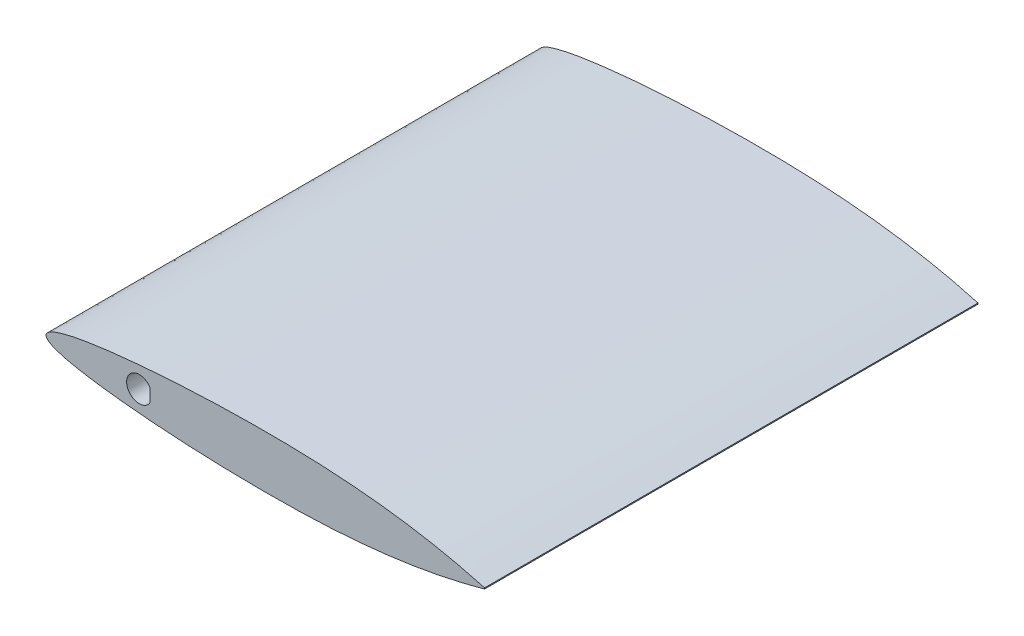
ISO-10303-21;
HEADER;
FILE_DESCRIPTION(('STEP AP214'),'2;1');
FILE_NAME('part.step','',(''),(''),'','','');
FILE_SCHEMA(('AUTOMOTIVE_DESIGN { 1 0 10303 214 1 1 1 1 }'));
ENDSEC;
DATA;
#1=APPLICATION_CONTEXT('core data for automotive mechanical design processes');
#2=APPLICATION_PROTOCOL_DEFINITION('international standard','automotive_design',2000,#1);
#3=PRODUCT_CONTEXT('',#1,'mechanical');
#4=PRODUCT('Part','Part','',(#3));
#5=PRODUCT_RELATED_PRODUCT_CATEGORY('part','',(#4));
#6=PRODUCT_DEFINITION_FORMATION('','',#4);
#7=PRODUCT_DEFINITION_CONTEXT('part definition',#1,'design');
#8=PRODUCT_DEFINITION('design','',#6,#7);
#9=PRODUCT_DEFINITION_SHAPE('','',#8);
#10=(LENGTH_UNIT() NAMED_UNIT(*) SI_UNIT(.MILLI.,.METRE.));
#11=(NAMED_UNIT(*) PLANE_ANGLE_UNIT() SI_UNIT($,.RADIAN.));
#12=(NAMED_UNIT(*) SI_UNIT($,.STERADIAN.) SOLID_ANGLE_UNIT());
#13=UNCERTAINTY_MEASURE_WITH_UNIT(LENGTH_MEASURE(1.E-05),#10,'distance_accuracy_value','');
#14=(GEOMETRIC_REPRESENTATION_CONTEXT(3) GLOBAL_UNCERTAINTY_ASSIGNED_CONTEXT((#13)) GLOBAL_UNIT_ASSIGNED_CONTEXT((#10,
#11,#12)) REPRESENTATION_CONTEXT('',''));
#15=CARTESIAN_POINT('',(0.,0.,0.));
#16=DIRECTION('',(0.,0.,1.));
#17=DIRECTION('',(1.,0.,0.));
#18=AXIS2_PLACEMENT_3D('',#15,#16,#17);
#19=CARTESIAN_POINT('',(0.,0.,114.3));
#20=DIRECTION('',(0.,0.,-1.));
#21=DIRECTION('',(-1.,0.,0.));
#22=AXIS2_PLACEMENT_3D('',#19,#20,#21);
#23=PLANE('',#22);
#24=CARTESIAN_POINT('',(101.6,0.12192,114.3));
#25=CARTESIAN_POINT('',(99.9099325612772,0.573751352181052,114.3));
#26=CARTESIAN_POINT('',(96.5445159680375,1.47347919447663,114.3));
#27=CARTESIAN_POINT('',(89.7838148331715,2.94708160059314,114.3));
#28=CARTESIAN_POINT('',(81.3219135939672,4.36676175035151,114.3));
#29=CARTESIAN_POINT('',(71.1402798710456,5.43635651611942,114.3));
#30=CARTESIAN_POINT('',(60.9671026158848,5.99664541123932,114.3));
#31=CARTESIAN_POINT('',(50.8000062626756,6.1452466793128,114.3));
#32=CARTESIAN_POINT('',(40.6356759168472,5.99825351295323,114.3));
#33=CARTESIAN_POINT('',(30.4708305225493,5.55295405436998,114.3));
#34=CARTESIAN_POINT('',(22.0030483871038,4.93293242186221,114.3));
#35=CARTESIAN_POINT('',(15.230811890989,4.22316272662785,114.3));
#36=CARTESIAN_POINT('',(10.9986814626437,3.664214628241,114.3));
#37=CARTESIAN_POINT('',(7.60803033342346,3.09224166583172,114.3));
#38=CARTESIAN_POINT('',(5.07214941301361,2.58080453358446,114.3));
#39=CARTESIAN_POINT('',(2.89436287038461,1.97088859116428,114.3));
#40=CARTESIAN_POINT('',(1.18166517439631,1.36420918614566,114.3));
#41=CARTESIAN_POINT('',(-0.674617494040787,0.,114.3));
#42=CARTESIAN_POINT('',(1.18166517439633,-1.36420918614567,114.3));
#43=CARTESIAN_POINT('',(2.89436287038458,-1.97088859116427,114.3));
#44=CARTESIAN_POINT('',(5.07214941301364,-2.58080453358447,114.3));
#45=CARTESIAN_POINT('',(7.60803033342344,-3.09224166583172,114.3));
#46=CARTESIAN_POINT('',(10.9986814626437,-3.66421462824101,114.3));
#47=CARTESIAN_POINT('',(15.230811890989,-4.22316272662785,114.3));
#48=CARTESIAN_POINT('',(22.0030483871038,-4.93293242186221,114.3));
#49=CARTESIAN_POINT('',(30.4708305225493,-5.55295405436998,114.3));
#50=CARTESIAN_POINT('',(40.6356759168473,-5.99825351295323,114.3));
#51=CARTESIAN_POINT('',(50.8000062626756,-6.1452466793128,114.3));
#52=CARTESIAN_POINT('',(60.9671026158848,-5.99664541123932,114.3));
#53=CARTESIAN_POINT('',(71.1402798710456,-5.43635651611942,114.3));
#54=CARTESIAN_POINT('',(81.3219135939672,-4.3667617503515,114.3));
#55=CARTESIAN_POINT('',(89.7838148331716,-2.94708160059315,114.3));
#56=CARTESIAN_POINT('',(96.5445159680374,-1.47347919447663,114.3));
#57=CARTESIAN_POINT('',(99.9099325612772,-0.573751352181052,114.3));
#58=CARTESIAN_POINT('',(101.6,-0.12192,114.3));
#59=B_SPLINE_CURVE_WITH_KNOTS('',3,(#24,#25,#26,#27,#28,#29,#30,#31,#32,#33,#34,#35,#36,#37,#38,
#39,#40,#41,#42,#43,#44,#45,#46,#47,#48,#49,#50,#51,#52,#53,#54,#55,#56,#57,#58),.UNSPECIFIED.,
.F.,.F.,(4,1,1,1,1,1,1,1,1,1,1,1,1,1,1,1,1,1,1,1,1,1,1,1,1,1,1,1,1,1,1,1,4),(0.,
0.0254561411236664,0.0506905924429752,0.100668945434382,0.150236314349449,0.19960123058025,
0.24889397315785,0.298185188052663,0.347518475522579,0.396944040111351,0.421724595809467,
0.44659314081436,0.4590914269835,0.471679671517261,0.484480399814962,0.491139796608888,0.5,
0.508860203391112,0.515519600185038,0.528320328482739,0.5409085730165,0.55340685918564,
0.578275404190533,0.603055959888649,0.652481524477421,0.701814811947337,0.75110602684215,
0.80039876941975,0.849763685650551,0.899331054565618,0.949309407557025,0.974543858876334,1.),.UNSPECIFIED.);
#60=CARTESIAN_POINT('',(101.6,0.12192,114.3));
#61=VERTEX_POINT('',#60);
#62=CARTESIAN_POINT('',(101.6,-0.12192,114.3));
#63=VERTEX_POINT('',#62);
#64=EDGE_CURVE('E91',#61,#63,#59,.T.);
#65=ORIENTED_EDGE('',*,*,#64,.T.);
#66=DIRECTION('',(0.,1.,0.));
#67=VECTOR('',#66,1.);
#68=CARTESIAN_POINT('',(101.6,0.12192,114.3));
#69=LINE('',#68,#67);
#70=EDGE_CURVE('E97',#63,#61,#69,.T.);
#71=ORIENTED_EDGE('',*,*,#70,.T.);
#72=EDGE_LOOP('',(#65,#71));
#73=FACE_BOUND('',#72,.T.);
#74=DIRECTION('',(0.,-1.,0.));
#75=VECTOR('',#74,1.);
#76=CARTESIAN_POINT('',(24.0567191027873,0.,114.3));
#77=LINE('',#76,#75);
#78=CARTESIAN_POINT('',(24.0567191027873,1.5875,114.3));
#79=VERTEX_POINT('',#78);
#80=CARTESIAN_POINT('',(24.0567191027873,-1.5875,114.3));
#81=VERTEX_POINT('',#80);
#82=EDGE_CURVE('E49',#79,#81,#77,.T.);
#83=ORIENTED_EDGE('',*,*,#82,.T.);
#84=CARTESIAN_POINT('',(21.6,0.,114.3));
#85=DIRECTION('',(0.,0.,1.));
#86=DIRECTION('',(1.,0.,0.));
#87=AXIS2_PLACEMENT_3D('',#84,#85,#86);
#88=CIRCLE('',#87,2.925);
#89=EDGE_CURVE('E85',#79,#81,#88,.T.);
#90=ORIENTED_EDGE('',*,*,#89,.F.);
#91=EDGE_LOOP('',(#83,#90));
#92=FACE_BOUND('',#91,.T.);
#93=ADVANCED_FACE('F33',(#73,#92),#23,.F.);
#94=CARTESIAN_POINT('',(0.,0.,0.));
#95=DIRECTION('',(0.,0.,-1.));
#96=DIRECTION('',(-1.,0.,0.));
#97=AXIS2_PLACEMENT_3D('',#94,#95,#96);
#98=PLANE('',#97);
#99=CARTESIAN_POINT('',(101.6,0.12192,0.));
#100=CARTESIAN_POINT('',(99.9099325612772,0.573751352181052,0.));
#101=CARTESIAN_POINT('',(96.5445159680375,1.47347919447663,0.));
#102=CARTESIAN_POINT('',(89.7838148331715,2.94708160059314,0.));
#103=CARTESIAN_POINT('',(81.3219135939672,4.36676175035151,0.));
#104=CARTESIAN_POINT('',(71.1402798710456,5.43635651611942,0.));
#105=CARTESIAN_POINT('',(60.9671026158848,5.99664541123932,0.));
#106=CARTESIAN_POINT('',(50.8000062626756,6.1452466793128,0.));
#107=CARTESIAN_POINT('',(40.6356759168472,5.99825351295323,0.));
#108=CARTESIAN_POINT('',(30.4708305225493,5.55295405436998,0.));
#109=CARTESIAN_POINT('',(22.0030483871038,4.93293242186221,0.));
#110=CARTESIAN_POINT('',(15.230811890989,4.22316272662785,0.));
#111=CARTESIAN_POINT('',(10.9986814626437,3.664214628241,0.));
#112=CARTESIAN_POINT('',(7.60803033342346,3.09224166583172,0.));
#113=CARTESIAN_POINT('',(5.07214941301361,2.58080453358446,0.));
#114=CARTESIAN_POINT('',(2.89436287038461,1.97088859116428,0.));
#115=CARTESIAN_POINT('',(1.18166517439631,1.36420918614566,0.));
#116=CARTESIAN_POINT('',(-0.674617494040787,0.,0.));
#117=CARTESIAN_POINT('',(1.18166517439633,-1.36420918614567,0.));
#118=CARTESIAN_POINT('',(2.89436287038458,-1.97088859116427,0.));
#119=CARTESIAN_POINT('',(5.07214941301364,-2.58080453358447,0.));
#120=CARTESIAN_POINT('',(7.60803033342344,-3.09224166583172,0.));
#121=CARTESIAN_POINT('',(10.9986814626437,-3.66421462824101,0.));
#122=CARTESIAN_POINT('',(15.230811890989,-4.22316272662785,0.));
#123=CARTESIAN_POINT('',(22.0030483871038,-4.93293242186221,0.));
#124=CARTESIAN_POINT('',(30.4708305225493,-5.55295405436998,0.));
#125=CARTESIAN_POINT('',(40.6356759168473,-5.99825351295323,0.));
#126=CARTESIAN_POINT('',(50.8000062626756,-6.1452466793128,0.));
#127=CARTESIAN_POINT('',(60.9671026158848,-5.99664541123932,0.));
#128=CARTESIAN_POINT('',(71.1402798710456,-5.43635651611942,0.));
#129=CARTESIAN_POINT('',(81.3219135939672,-4.3667617503515,0.));
#130=CARTESIAN_POINT('',(89.7838148331716,-2.94708160059315,0.));
#131=CARTESIAN_POINT('',(96.5445159680374,-1.47347919447663,0.));
#132=CARTESIAN_POINT('',(99.9099325612772,-0.573751352181052,0.));
#133=CARTESIAN_POINT('',(101.6,-0.12192,0.));
#134=B_SPLINE_CURVE_WITH_KNOTS('',3,(#99,#100,#101,#102,#103,#104,#105,#106,#107,#108,#109,#110,
#111,#112,#113,#114,#115,#116,#117,#118,#119,#120,#121,#122,#123,#124,#125,#126,#127,#128,#129,
#130,#131,#132,#133),.UNSPECIFIED.,.F.,.F.,(4,1,1,1,1,1,1,1,1,1,1,1,1,1,1,1,1,1,1,1,1,1,1,1,1,1,
1,1,1,1,1,1,4),(0.,0.0254561411236664,0.0506905924429752,0.100668945434382,0.150236314349449,
0.19960123058025,0.24889397315785,0.298185188052663,0.347518475522579,0.396944040111351,
0.421724595809467,0.44659314081436,0.4590914269835,0.471679671517261,0.484480399814962,
0.491139796608888,0.5,0.508860203391112,0.515519600185038,0.528320328482739,0.5409085730165,
0.55340685918564,0.578275404190533,0.603055959888649,0.652481524477421,0.701814811947337,
0.75110602684215,0.80039876941975,0.849763685650551,0.899331054565618,0.949309407557025,
0.974543858876334,1.),.UNSPECIFIED.);
#135=CARTESIAN_POINT('',(101.6,0.12192,0.));
#136=VERTEX_POINT('',#135);
#137=CARTESIAN_POINT('',(101.6,-0.12192,0.));
#138=VERTEX_POINT('',#137);
#139=EDGE_CURVE('E90',#136,#138,#134,.T.);
#140=ORIENTED_EDGE('',*,*,#139,.F.);
#141=DIRECTION('',(0.,1.,0.));
#142=VECTOR('',#141,1.);
#143=CARTESIAN_POINT('',(101.6,0.12192,0.));
#144=LINE('',#143,#142);
#145=EDGE_CURVE('E98',#138,#136,#144,.T.);
#146=ORIENTED_EDGE('',*,*,#145,.F.);
#147=EDGE_LOOP('',(#140,#146));
#148=FACE_BOUND('',#147,.T.);
#149=CARTESIAN_POINT('',(21.6,0.,0.));
#150=DIRECTION('',(0.,0.,1.));
#151=DIRECTION('',(1.,0.,0.));
#152=AXIS2_PLACEMENT_3D('',#149,#150,#151);
#153=CIRCLE('',#152,2.925);
#154=CARTESIAN_POINT('',(24.0567191027873,1.5875,0.));
#155=VERTEX_POINT('',#154);
#156=CARTESIAN_POINT('',(24.0567191027873,-1.5875,0.));
#157=VERTEX_POINT('',#156);
#158=EDGE_CURVE('E79',#155,#157,#153,.T.);
#159=ORIENTED_EDGE('',*,*,#158,.T.);
#160=DIRECTION('',(0.,-1.,0.));
#161=VECTOR('',#160,1.);
#162=CARTESIAN_POINT('',(24.0567191027873,0.,0.));
#163=LINE('',#162,#161);
#164=EDGE_CURVE('E76',#155,#157,#163,.T.);
#165=ORIENTED_EDGE('',*,*,#164,.F.);
#166=EDGE_LOOP('',(#159,#165));
#167=FACE_BOUND('',#166,.T.);
#168=ADVANCED_FACE('F84',(#148,#167),#98,.T.);
#169=DIRECTION('',(0.,0.,-1.));
#170=VECTOR('',#169,1.);
#171=SURFACE_OF_LINEAR_EXTRUSION('',#59,#170);
#172=ORIENTED_EDGE('',*,*,#139,.T.);
#173=DIRECTION('',(0.,0.,-1.));
#174=VECTOR('',#173,1.);
#175=CARTESIAN_POINT('',(101.6,-0.12192,114.3));
#176=LINE('',#175,#174);
#177=EDGE_CURVE('E11',#63,#138,#176,.T.);
#178=ORIENTED_EDGE('',*,*,#177,.F.);
#179=ORIENTED_EDGE('',*,*,#64,.F.);
#180=DIRECTION('',(0.,0.,-1.));
#181=VECTOR('',#180,1.);
#182=CARTESIAN_POINT('',(101.6,0.12192,114.3));
#183=LINE('',#182,#181);
#184=EDGE_CURVE('E42',#61,#136,#183,.T.);
#185=ORIENTED_EDGE('',*,*,#184,.T.);
#186=EDGE_LOOP('',(#172,#178,#179,#185));
#187=FACE_BOUND('',#186,.T.);
#188=ADVANCED_FACE('F35',(#187),#171,.F.);
#189=CARTESIAN_POINT('',(101.6,0.12192,114.3));
#190=DIRECTION('',(-1.,0.,0.));
#191=DIRECTION('',(0.,-1.,0.));
#192=AXIS2_PLACEMENT_3D('',#189,#190,#191);
#193=PLANE('',#192);
#194=ORIENTED_EDGE('',*,*,#145,.T.);
#195=ORIENTED_EDGE('',*,*,#184,.F.);
#196=ORIENTED_EDGE('',*,*,#70,.F.);
#197=ORIENTED_EDGE('',*,*,#177,.T.);
#198=EDGE_LOOP('',(#194,#195,#196,#197));
#199=FACE_BOUND('',#198,.T.);
#200=ADVANCED_FACE('F118',(#199),#193,.F.);
#201=CARTESIAN_POINT('',(24.0567191027873,0.,0.));
#202=DIRECTION('',(-1.,0.,0.));
#203=DIRECTION('',(0.,0.,1.));
#204=AXIS2_PLACEMENT_3D('',#201,#202,#203);
#205=PLANE('',#204);
#206=ORIENTED_EDGE('',*,*,#82,.F.);
#207=DIRECTION('',(0.,0.,1.));
#208=VECTOR('',#207,1.);
#209=CARTESIAN_POINT('',(24.0567191027873,1.5875,0.));
#210=LINE('',#209,#208);
#211=EDGE_CURVE('E73',#155,#79,#210,.T.);
#212=ORIENTED_EDGE('',*,*,#211,.F.);
#213=ORIENTED_EDGE('',*,*,#164,.T.);
#214=DIRECTION('',(0.,0.,1.));
#215=VECTOR('',#214,1.);
#216=CARTESIAN_POINT('',(24.0567191027873,-1.5875,0.));
#217=LINE('',#216,#215);
#218=EDGE_CURVE('E56',#157,#81,#217,.T.);
#219=ORIENTED_EDGE('',*,*,#218,.T.);
#220=EDGE_LOOP('',(#206,#212,#213,#219));
#221=FACE_BOUND('',#220,.T.);
#222=ADVANCED_FACE('F74',(#221),#205,.T.);
#223=CARTESIAN_POINT('',(21.6,0.,0.));
#224=DIRECTION('',(0.,0.,1.));
#225=DIRECTION('',(1.,0.,0.));
#226=AXIS2_PLACEMENT_3D('',#223,#224,#225);
#227=CYLINDRICAL_SURFACE('',#226,2.925);
#228=ORIENTED_EDGE('',*,*,#89,.T.);
#229=ORIENTED_EDGE('',*,*,#218,.F.);
#230=ORIENTED_EDGE('',*,*,#158,.F.);
#231=ORIENTED_EDGE('',*,*,#211,.T.);
#232=EDGE_LOOP('',(#228,#229,#230,#231));
#233=FACE_BOUND('',#232,.T.);
#234=ADVANCED_FACE('F81',(#233),#227,.F.);
#235=CLOSED_SHELL('',(#93,#168,#188,#200,#222,#234));
#236=MANIFOLD_SOLID_BREP('B2',#235);
#237=ADVANCED_BREP_SHAPE_REPRESENTATION('',(#18,#236),#14);
#238=SHAPE_DEFINITION_REPRESENTATION(#9,#237);
ENDSEC;
END-ISO-10303-21;
